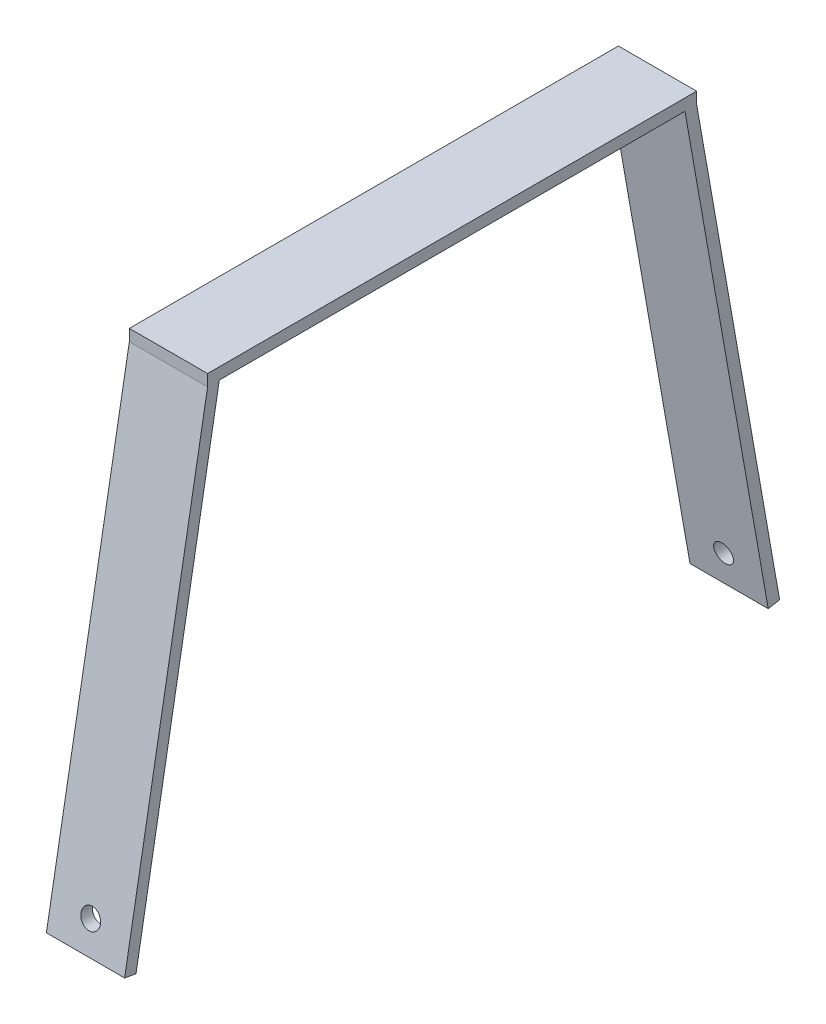
ISO-10303-21;
HEADER;
FILE_DESCRIPTION(('STEP AP214'),'2;1');
FILE_NAME('part.step','',(''),(''),'','','');
FILE_SCHEMA(('AUTOMOTIVE_DESIGN { 1 0 10303 214 1 1 1 1 }'));
ENDSEC;
DATA;
#1=APPLICATION_CONTEXT('core data for automotive mechanical design processes');
#2=APPLICATION_PROTOCOL_DEFINITION('international standard','automotive_design',2000,#1);
#3=PRODUCT_CONTEXT('',#1,'mechanical');
#4=PRODUCT('Part','Part','',(#3));
#5=PRODUCT_RELATED_PRODUCT_CATEGORY('part','',(#4));
#6=PRODUCT_DEFINITION_FORMATION('','',#4);
#7=PRODUCT_DEFINITION_CONTEXT('part definition',#1,'design');
#8=PRODUCT_DEFINITION('design','',#6,#7);
#9=PRODUCT_DEFINITION_SHAPE('','',#8);
#10=(LENGTH_UNIT() NAMED_UNIT(*) SI_UNIT(.MILLI.,.METRE.));
#11=(NAMED_UNIT(*) PLANE_ANGLE_UNIT() SI_UNIT($,.RADIAN.));
#12=(NAMED_UNIT(*) SI_UNIT($,.STERADIAN.) SOLID_ANGLE_UNIT());
#13=UNCERTAINTY_MEASURE_WITH_UNIT(LENGTH_MEASURE(1.E-05),#10,'distance_accuracy_value','');
#14=(GEOMETRIC_REPRESENTATION_CONTEXT(3) GLOBAL_UNCERTAINTY_ASSIGNED_CONTEXT((#13)) GLOBAL_UNIT_ASSIGNED_CONTEXT((#10,
#11,#12)) REPRESENTATION_CONTEXT('',''));
#15=CARTESIAN_POINT('',(0.,0.,0.));
#16=DIRECTION('',(0.,0.,1.));
#17=DIRECTION('',(1.,0.,0.));
#18=AXIS2_PLACEMENT_3D('',#15,#16,#17);
#19=CARTESIAN_POINT('',(0.,0.,0.));
#20=DIRECTION('',(0.,-1.,0.));
#21=DIRECTION('',(0.,0.,-1.));
#22=AXIS2_PLACEMENT_3D('',#19,#20,#21);
#23=PLANE('',#22);
#24=DIRECTION('',(0.,0.,1.));
#25=VECTOR('',#24,1.);
#26=CARTESIAN_POINT('',(-10.16,0.,63.5));
#27=LINE('',#26,#25);
#28=CARTESIAN_POINT('',(-10.16,0.,-60.4537262569024));
#29=VERTEX_POINT('',#28);
#30=CARTESIAN_POINT('',(-10.16,0.,60.4537262569024));
#31=VERTEX_POINT('',#30);
#32=EDGE_CURVE('E122',#29,#31,#27,.T.);
#33=ORIENTED_EDGE('',*,*,#32,.F.);
#34=DIRECTION('',(1.,0.,0.));
#35=VECTOR('',#34,1.);
#36=CARTESIAN_POINT('',(0.,0.,-60.4537262569024));
#37=LINE('',#36,#35);
#38=CARTESIAN_POINT('',(10.16,0.,-60.4537262569024));
#39=VERTEX_POINT('',#38);
#40=EDGE_CURVE('E159',#29,#39,#37,.T.);
#41=ORIENTED_EDGE('',*,*,#40,.T.);
#42=DIRECTION('',(0.,0.,-1.));
#43=VECTOR('',#42,1.);
#44=CARTESIAN_POINT('',(10.16,0.,63.5));
#45=LINE('',#44,#43);
#46=CARTESIAN_POINT('',(10.16,0.,60.4537262569024));
#47=VERTEX_POINT('',#46);
#48=EDGE_CURVE('E117',#47,#39,#45,.T.);
#49=ORIENTED_EDGE('',*,*,#48,.F.);
#50=DIRECTION('',(-1.,0.,0.));
#51=VECTOR('',#50,1.);
#52=CARTESIAN_POINT('',(0.,0.,60.4537262569024));
#53=LINE('',#52,#51);
#54=EDGE_CURVE('E11',#47,#31,#53,.T.);
#55=ORIENTED_EDGE('',*,*,#54,.T.);
#56=EDGE_LOOP('',(#33,#41,#49,#55));
#57=FACE_BOUND('',#56,.T.);
#58=ADVANCED_FACE('F35',(#57),#23,.T.);
#59=CARTESIAN_POINT('',(10.16,2.999994,63.5));
#60=DIRECTION('',(0.,0.,-1.));
#61=DIRECTION('',(-1.,0.,0.));
#62=AXIS2_PLACEMENT_3D('',#59,#60,#61);
#63=PLANE('',#62);
#64=DIRECTION('',(1.,0.,0.));
#65=VECTOR('',#64,1.);
#66=CARTESIAN_POINT('',(10.16,0.,63.5));
#67=LINE('',#66,#65);
#68=CARTESIAN_POINT('',(-10.16,0.,63.5));
#69=VERTEX_POINT('',#68);
#70=CARTESIAN_POINT('',(10.16,0.,63.5));
#71=VERTEX_POINT('',#70);
#72=EDGE_CURVE('E114',#69,#71,#67,.T.);
#73=ORIENTED_EDGE('',*,*,#72,.T.);
#74=DIRECTION('',(0.,-1.,0.));
#75=VECTOR('',#74,1.);
#76=CARTESIAN_POINT('',(10.16,2.999994,63.5));
#77=LINE('',#76,#75);
#78=CARTESIAN_POINT('',(10.16,2.999994,63.5));
#79=VERTEX_POINT('',#78);
#80=EDGE_CURVE('E45',#79,#71,#77,.T.);
#81=ORIENTED_EDGE('',*,*,#80,.F.);
#82=DIRECTION('',(1.,0.,0.));
#83=VECTOR('',#82,1.);
#84=CARTESIAN_POINT('',(10.16,2.999994,63.5));
#85=LINE('',#84,#83);
#86=CARTESIAN_POINT('',(-10.16,2.999994,63.5));
#87=VERTEX_POINT('',#86);
#88=EDGE_CURVE('E90',#87,#79,#85,.T.);
#89=ORIENTED_EDGE('',*,*,#88,.F.);
#90=DIRECTION('',(0.,-1.,0.));
#91=VECTOR('',#90,1.);
#92=CARTESIAN_POINT('',(-10.16,2.999994,63.5));
#93=LINE('',#92,#91);
#94=EDGE_CURVE('E110',#87,#69,#93,.T.);
#95=ORIENTED_EDGE('',*,*,#94,.T.);
#96=EDGE_LOOP('',(#73,#81,#89,#95));
#97=FACE_BOUND('',#96,.T.);
#98=ADVANCED_FACE('F37',(#97),#63,.F.);
#99=CARTESIAN_POINT('',(10.16,2.999994,63.5));
#100=DIRECTION('',(-1.,0.,0.));
#101=DIRECTION('',(0.,0.,1.));
#102=AXIS2_PLACEMENT_3D('',#99,#100,#101);
#103=PLANE('',#102);
#104=ORIENTED_EDGE('',*,*,#48,.T.);
#105=DIRECTION('',(0.,-0.984807753012208,-0.173648177666931));
#106=VECTOR('',#105,1.);
#107=CARTESIAN_POINT('',(10.16,10.3381960594783,-58.6308233597625));
#108=LINE('',#107,#106);
#109=CARTESIAN_POINT('',(10.16,-122.681995011561,-82.085872024582));
#110=VERTEX_POINT('',#109);
#111=EDGE_CURVE('E172',#39,#110,#108,.T.);
#112=ORIENTED_EDGE('',*,*,#111,.T.);
#113=DIRECTION('',(0.,0.173648177666931,-0.984807753012208));
#114=VECTOR('',#113,1.);
#115=CARTESIAN_POINT('',(10.16,-122.681995011561,-82.085872024582));
#116=LINE('',#115,#114);
#117=CARTESIAN_POINT('',(10.16,-122.161051520449,-85.0402893747721));
#118=VERTEX_POINT('',#117);
#119=EDGE_CURVE('E161',#110,#118,#116,.T.);
#120=ORIENTED_EDGE('',*,*,#119,.T.);
#121=DIRECTION('',(0.,-0.984807753012208,-0.173648177666931));
#122=VECTOR('',#121,1.);
#123=CARTESIAN_POINT('',(10.16,10.85913955059,-61.5852407099526));
#124=LINE('',#123,#122);
#125=CARTESIAN_POINT('',(10.16,0.,-63.5));
#126=VERTEX_POINT('',#125);
#127=EDGE_CURVE('E102',#126,#118,#124,.T.);
#128=ORIENTED_EDGE('',*,*,#127,.F.);
#129=DIRECTION('',(0.,-1.,0.));
#130=VECTOR('',#129,1.);
#131=CARTESIAN_POINT('',(10.16,2.999994,-63.5));
#132=LINE('',#131,#130);
#133=CARTESIAN_POINT('',(10.16,2.999994,-63.5));
#134=VERTEX_POINT('',#133);
#135=EDGE_CURVE('E96',#134,#126,#132,.T.);
#136=ORIENTED_EDGE('',*,*,#135,.F.);
#137=DIRECTION('',(0.,0.,-1.));
#138=VECTOR('',#137,1.);
#139=CARTESIAN_POINT('',(10.16,2.999994,63.5));
#140=LINE('',#139,#138);
#141=EDGE_CURVE('E83',#79,#134,#140,.T.);
#142=ORIENTED_EDGE('',*,*,#141,.F.);
#143=ORIENTED_EDGE('',*,*,#80,.T.);
#144=DIRECTION('',(0.,-0.984807753012208,0.173648177666931));
#145=VECTOR('',#144,1.);
#146=CARTESIAN_POINT('',(10.16,10.85913955059,61.5852407099526));
#147=LINE('',#146,#145);
#148=CARTESIAN_POINT('',(10.16,-122.161051520449,85.0402893747721));
#149=VERTEX_POINT('',#148);
#150=EDGE_CURVE('E65',#71,#149,#147,.T.);
#151=ORIENTED_EDGE('',*,*,#150,.T.);
#152=DIRECTION('',(0.,0.173648177666931,0.984807753012208));
#153=VECTOR('',#152,1.);
#154=CARTESIAN_POINT('',(10.16,-122.681995011561,82.085872024582));
#155=LINE('',#154,#153);
#156=CARTESIAN_POINT('',(10.16,-122.681995011561,82.085872024582));
#157=VERTEX_POINT('',#156);
#158=EDGE_CURVE('E153',#157,#149,#155,.T.);
#159=ORIENTED_EDGE('',*,*,#158,.F.);
#160=DIRECTION('',(0.,-0.984807753012208,0.173648177666931));
#161=VECTOR('',#160,1.);
#162=CARTESIAN_POINT('',(10.16,10.3381960594783,58.6308233597625));
#163=LINE('',#162,#161);
#164=EDGE_CURVE('E146',#47,#157,#163,.T.);
#165=ORIENTED_EDGE('',*,*,#164,.F.);
#166=EDGE_LOOP('',(#104,#112,#120,#128,#136,#142,#143,#151,#159,#165));
#167=FACE_BOUND('',#166,.T.);
#168=ADVANCED_FACE('F98',(#167),#103,.F.);
#169=CARTESIAN_POINT('',(-10.16,2.999994,-63.5));
#170=DIRECTION('',(0.,0.,1.));
#171=DIRECTION('',(1.,0.,0.));
#172=AXIS2_PLACEMENT_3D('',#169,#170,#171);
#173=PLANE('',#172);
#174=DIRECTION('',(-1.,0.,0.));
#175=VECTOR('',#174,1.);
#176=CARTESIAN_POINT('',(-10.16,0.,-63.5));
#177=LINE('',#176,#175);
#178=CARTESIAN_POINT('',(-10.16,0.,-63.5));
#179=VERTEX_POINT('',#178);
#180=EDGE_CURVE('E120',#126,#179,#177,.T.);
#181=ORIENTED_EDGE('',*,*,#180,.T.);
#182=DIRECTION('',(0.,-1.,0.));
#183=VECTOR('',#182,1.);
#184=CARTESIAN_POINT('',(-10.16,2.999994,-63.5));
#185=LINE('',#184,#183);
#186=CARTESIAN_POINT('',(-10.16,2.999994,-63.5));
#187=VERTEX_POINT('',#186);
#188=EDGE_CURVE('E105',#187,#179,#185,.T.);
#189=ORIENTED_EDGE('',*,*,#188,.F.);
#190=DIRECTION('',(-1.,0.,0.));
#191=VECTOR('',#190,1.);
#192=CARTESIAN_POINT('',(-10.16,2.999994,-63.5));
#193=LINE('',#192,#191);
#194=EDGE_CURVE('E87',#134,#187,#193,.T.);
#195=ORIENTED_EDGE('',*,*,#194,.F.);
#196=ORIENTED_EDGE('',*,*,#135,.T.);
#197=EDGE_LOOP('',(#181,#189,#195,#196));
#198=FACE_BOUND('',#197,.T.);
#199=ADVANCED_FACE('F107',(#198),#173,.F.);
#200=CARTESIAN_POINT('',(-10.16,2.999994,63.5));
#201=DIRECTION('',(1.,0.,0.));
#202=DIRECTION('',(0.,0.,-1.));
#203=AXIS2_PLACEMENT_3D('',#200,#201,#202);
#204=PLANE('',#203);
#205=ORIENTED_EDGE('',*,*,#188,.T.);
#206=DIRECTION('',(0.,0.984807753012208,0.173648177666931));
#207=VECTOR('',#206,1.);
#208=CARTESIAN_POINT('',(-10.16,10.85913955059,-61.5852407099526));
#209=LINE('',#208,#207);
#210=CARTESIAN_POINT('',(-10.16,-122.161051520449,-85.0402893747721));
#211=VERTEX_POINT('',#210);
#212=EDGE_CURVE('E176',#211,#179,#209,.T.);
#213=ORIENTED_EDGE('',*,*,#212,.F.);
#214=DIRECTION('',(0.,0.173648177666931,-0.984807753012208));
#215=VECTOR('',#214,1.);
#216=CARTESIAN_POINT('',(-10.16,-122.681995011561,-82.085872024582));
#217=LINE('',#216,#215);
#218=CARTESIAN_POINT('',(-10.16,-122.681995011561,-82.085872024582));
#219=VERTEX_POINT('',#218);
#220=EDGE_CURVE('E168',#219,#211,#217,.T.);
#221=ORIENTED_EDGE('',*,*,#220,.F.);
#222=DIRECTION('',(0.,0.984807753012208,0.173648177666931));
#223=VECTOR('',#222,1.);
#224=CARTESIAN_POINT('',(-10.16,10.3381960594783,-58.6308233597625));
#225=LINE('',#224,#223);
#226=EDGE_CURVE('E184',#219,#29,#225,.T.);
#227=ORIENTED_EDGE('',*,*,#226,.T.);
#228=ORIENTED_EDGE('',*,*,#32,.T.);
#229=DIRECTION('',(0.,0.984807753012208,-0.173648177666931));
#230=VECTOR('',#229,1.);
#231=CARTESIAN_POINT('',(-10.16,10.3381960594783,58.6308233597625));
#232=LINE('',#231,#230);
#233=CARTESIAN_POINT('',(-10.16,-122.681995011561,82.085872024582));
#234=VERTEX_POINT('',#233);
#235=EDGE_CURVE('E154',#234,#31,#232,.T.);
#236=ORIENTED_EDGE('',*,*,#235,.F.);
#237=DIRECTION('',(0.,0.173648177666931,0.984807753012208));
#238=VECTOR('',#237,1.);
#239=CARTESIAN_POINT('',(-10.16,-122.681995011561,82.085872024582));
#240=LINE('',#239,#238);
#241=CARTESIAN_POINT('',(-10.16,-122.161051520449,85.0402893747721));
#242=VERTEX_POINT('',#241);
#243=EDGE_CURVE('E118',#234,#242,#240,.T.);
#244=ORIENTED_EDGE('',*,*,#243,.T.);
#245=DIRECTION('',(0.,0.984807753012208,-0.173648177666931));
#246=VECTOR('',#245,1.);
#247=CARTESIAN_POINT('',(-10.16,10.85913955059,61.5852407099526));
#248=LINE('',#247,#246);
#249=EDGE_CURVE('E135',#242,#69,#248,.T.);
#250=ORIENTED_EDGE('',*,*,#249,.T.);
#251=ORIENTED_EDGE('',*,*,#94,.F.);
#252=DIRECTION('',(0.,0.,1.));
#253=VECTOR('',#252,1.);
#254=CARTESIAN_POINT('',(-10.16,2.999994,63.5));
#255=LINE('',#254,#253);
#256=EDGE_CURVE('E53',#187,#87,#255,.T.);
#257=ORIENTED_EDGE('',*,*,#256,.F.);
#258=EDGE_LOOP('',(#205,#213,#221,#227,#228,#236,#244,#250,#251,#257));
#259=FACE_BOUND('',#258,.T.);
#260=ADVANCED_FACE('F140',(#259),#204,.F.);
#261=CARTESIAN_POINT('',(0.,2.999994,0.));
#262=DIRECTION('',(0.,-1.,0.));
#263=DIRECTION('',(0.,0.,-1.));
#264=AXIS2_PLACEMENT_3D('',#261,#262,#263);
#265=PLANE('',#264);
#266=ORIENTED_EDGE('',*,*,#88,.T.);
#267=ORIENTED_EDGE('',*,*,#141,.T.);
#268=ORIENTED_EDGE('',*,*,#194,.T.);
#269=ORIENTED_EDGE('',*,*,#256,.T.);
#270=EDGE_LOOP('',(#266,#267,#268,#269));
#271=FACE_BOUND('',#270,.T.);
#272=ADVANCED_FACE('F85',(#271),#265,.F.);
#273=CARTESIAN_POINT('',(0.,-122.681995011561,82.085872024582));
#274=DIRECTION('',(0.,-0.984807753012208,0.173648177666931));
#275=DIRECTION('',(0.,-0.173648177666931,-0.984807753012208));
#276=AXIS2_PLACEMENT_3D('',#273,#274,#275);
#277=PLANE('',#276);
#278=DIRECTION('',(1.,0.,0.));
#279=VECTOR('',#278,1.);
#280=CARTESIAN_POINT('',(0.,-122.161051520449,85.0402893747721));
#281=LINE('',#280,#279);
#282=EDGE_CURVE('E148',#242,#149,#281,.T.);
#283=ORIENTED_EDGE('',*,*,#282,.F.);
#284=ORIENTED_EDGE('',*,*,#243,.F.);
#285=DIRECTION('',(1.,0.,0.));
#286=VECTOR('',#285,1.);
#287=CARTESIAN_POINT('',(0.,-122.681995011561,82.085872024582));
#288=LINE('',#287,#286);
#289=EDGE_CURVE('E143',#234,#157,#288,.T.);
#290=ORIENTED_EDGE('',*,*,#289,.T.);
#291=ORIENTED_EDGE('',*,*,#158,.T.);
#292=EDGE_LOOP('',(#283,#284,#290,#291));
#293=FACE_BOUND('',#292,.T.);
#294=ADVANCED_FACE('F246',(#293),#277,.T.);
#295=CARTESIAN_POINT('',(0.,10.3381960594783,58.6308233597625));
#296=DIRECTION('',(0.,0.173648177666931,0.984807753012208));
#297=DIRECTION('',(0.,-0.984807753012208,0.173648177666931));
#298=AXIS2_PLACEMENT_3D('',#295,#296,#297);
#299=PLANE('',#298);
#300=CARTESIAN_POINT('',(0.,-114.541051520449,80.6504040386761));
#301=DIRECTION('',(0.,0.173648177666931,0.984807753012208));
#302=DIRECTION('',(0.,-0.984807753012208,0.173648177666931));
#303=AXIS2_PLACEMENT_3D('',#300,#301,#302);
#304=ELLIPSE('',#303,2.57918359418979,2.54);
#305=CARTESIAN_POINT('',(0.,-117.081051520449,81.0982745696756));
#306=VERTEX_POINT('',#305);
#307=EDGE_CURVE('E181',#306,#306,#304,.T.);
#308=ORIENTED_EDGE('',*,*,#307,.T.);
#309=EDGE_LOOP('',(#308));
#310=FACE_BOUND('',#309,.T.);
#311=ORIENTED_EDGE('',*,*,#54,.F.);
#312=ORIENTED_EDGE('',*,*,#164,.T.);
#313=ORIENTED_EDGE('',*,*,#289,.F.);
#314=ORIENTED_EDGE('',*,*,#235,.T.);
#315=EDGE_LOOP('',(#311,#312,#313,#314));
#316=FACE_BOUND('',#315,.T.);
#317=ADVANCED_FACE('F252',(#310,#316),#299,.F.);
#318=CARTESIAN_POINT('',(0.,10.85913955059,61.5852407099526));
#319=DIRECTION('',(0.,0.173648177666931,0.984807753012208));
#320=DIRECTION('',(0.,-0.984807753012208,0.173648177666931));
#321=AXIS2_PLACEMENT_3D('',#318,#319,#320);
#322=PLANE('',#321);
#323=CARTESIAN_POINT('',(0.,-114.541051520449,83.6966777817736));
#324=DIRECTION('',(0.,0.173648177666931,0.984807753012208));
#325=DIRECTION('',(0.,-0.984807753012208,0.173648177666931));
#326=AXIS2_PLACEMENT_3D('',#323,#324,#325);
#327=ELLIPSE('',#326,2.57918359418979,2.54);
#328=CARTESIAN_POINT('',(0.,-117.081051520449,84.1445483127731));
#329=VERTEX_POINT('',#328);
#330=EDGE_CURVE('E191',#329,#329,#327,.T.);
#331=ORIENTED_EDGE('',*,*,#330,.F.);
#332=EDGE_LOOP('',(#331));
#333=FACE_BOUND('',#332,.T.);
#334=ORIENTED_EDGE('',*,*,#150,.F.);
#335=ORIENTED_EDGE('',*,*,#72,.F.);
#336=ORIENTED_EDGE('',*,*,#249,.F.);
#337=ORIENTED_EDGE('',*,*,#282,.T.);
#338=EDGE_LOOP('',(#334,#335,#336,#337));
#339=FACE_BOUND('',#338,.T.);
#340=ADVANCED_FACE('F133',(#333,#339),#322,.T.);
#341=CARTESIAN_POINT('',(0.,10.85913955059,-61.5852407099526));
#342=DIRECTION('',(0.,0.173648177666931,-0.984807753012208));
#343=DIRECTION('',(0.,-0.984807753012208,-0.173648177666931));
#344=AXIS2_PLACEMENT_3D('',#341,#342,#343);
#345=PLANE('',#344);
#346=CARTESIAN_POINT('',(0.,-114.541051520449,-83.6966777817736));
#347=DIRECTION('',(0.,0.173648177666931,-0.984807753012208));
#348=DIRECTION('',(0.,0.984807753012208,0.173648177666931));
#349=AXIS2_PLACEMENT_3D('',#346,#347,#348);
#350=ELLIPSE('',#349,2.57918359418979,2.54);
#351=CARTESIAN_POINT('',(0.,-112.001051520449,-83.2488072507741));
#352=VERTEX_POINT('',#351);
#353=EDGE_CURVE('E194',#352,#352,#350,.T.);
#354=ORIENTED_EDGE('',*,*,#353,.F.);
#355=EDGE_LOOP('',(#354));
#356=FACE_BOUND('',#355,.T.);
#357=ORIENTED_EDGE('',*,*,#180,.F.);
#358=ORIENTED_EDGE('',*,*,#127,.T.);
#359=DIRECTION('',(1.,0.,0.));
#360=VECTOR('',#359,1.);
#361=CARTESIAN_POINT('',(0.,-122.161051520449,-85.0402893747721));
#362=LINE('',#361,#360);
#363=EDGE_CURVE('E178',#211,#118,#362,.T.);
#364=ORIENTED_EDGE('',*,*,#363,.F.);
#365=ORIENTED_EDGE('',*,*,#212,.T.);
#366=EDGE_LOOP('',(#357,#358,#364,#365));
#367=FACE_BOUND('',#366,.T.);
#368=ADVANCED_FACE('F265',(#356,#367),#345,.T.);
#369=CARTESIAN_POINT('',(0.,-122.681995011561,-82.085872024582));
#370=DIRECTION('',(0.,0.984807753012208,0.173648177666931));
#371=DIRECTION('',(0.,-0.173648177666931,0.984807753012208));
#372=AXIS2_PLACEMENT_3D('',#369,#370,#371);
#373=PLANE('',#372);
#374=ORIENTED_EDGE('',*,*,#363,.T.);
#375=ORIENTED_EDGE('',*,*,#119,.F.);
#376=DIRECTION('',(1.,0.,0.));
#377=VECTOR('',#376,1.);
#378=CARTESIAN_POINT('',(0.,-122.681995011561,-82.085872024582));
#379=LINE('',#378,#377);
#380=EDGE_CURVE('E175',#219,#110,#379,.T.);
#381=ORIENTED_EDGE('',*,*,#380,.F.);
#382=ORIENTED_EDGE('',*,*,#220,.T.);
#383=EDGE_LOOP('',(#374,#375,#381,#382));
#384=FACE_BOUND('',#383,.T.);
#385=ADVANCED_FACE('F213',(#384),#373,.F.);
#386=CARTESIAN_POINT('',(0.,10.3381960594783,-58.6308233597625));
#387=DIRECTION('',(0.,0.173648177666931,-0.984807753012208));
#388=DIRECTION('',(0.,-0.984807753012208,-0.173648177666931));
#389=AXIS2_PLACEMENT_3D('',#386,#387,#388);
#390=PLANE('',#389);
#391=CARTESIAN_POINT('',(0.,-114.541051520449,-80.6504040386761));
#392=DIRECTION('',(0.,0.173648177666931,-0.984807753012208));
#393=DIRECTION('',(0.,0.984807753012208,0.173648177666931));
#394=AXIS2_PLACEMENT_3D('',#391,#392,#393);
#395=ELLIPSE('',#394,2.57918359418979,2.54);
#396=CARTESIAN_POINT('',(0.,-112.001051520449,-80.2025335076766));
#397=VERTEX_POINT('',#396);
#398=EDGE_CURVE('E39',#397,#397,#395,.T.);
#399=ORIENTED_EDGE('',*,*,#398,.T.);
#400=EDGE_LOOP('',(#399));
#401=FACE_BOUND('',#400,.T.);
#402=ORIENTED_EDGE('',*,*,#40,.F.);
#403=ORIENTED_EDGE('',*,*,#226,.F.);
#404=ORIENTED_EDGE('',*,*,#380,.T.);
#405=ORIENTED_EDGE('',*,*,#111,.F.);
#406=EDGE_LOOP('',(#402,#403,#404,#405));
#407=FACE_BOUND('',#406,.T.);
#408=ADVANCED_FACE('F201',(#401,#407),#390,.F.);
#409=CARTESIAN_POINT('',(0.,-114.541051520449,-85.0402893747721));
#410=DIRECTION('',(0.,0.,1.));
#411=DIRECTION('',(1.,0.,0.));
#412=AXIS2_PLACEMENT_3D('',#409,#410,#411);
#413=CYLINDRICAL_SURFACE('',#412,2.54);
#414=ORIENTED_EDGE('',*,*,#353,.T.);
#415=EDGE_LOOP('',(#414));
#416=FACE_BOUND('',#415,.T.);
#417=ORIENTED_EDGE('',*,*,#398,.F.);
#418=EDGE_LOOP('',(#417));
#419=FACE_BOUND('',#418,.T.);
#420=ADVANCED_FACE('F204',(#416,#419),#413,.F.);
#421=ORIENTED_EDGE('',*,*,#330,.T.);
#422=EDGE_LOOP('',(#421));
#423=FACE_BOUND('',#422,.T.);
#424=ORIENTED_EDGE('',*,*,#307,.F.);
#425=EDGE_LOOP('',(#424));
#426=FACE_BOUND('',#425,.T.);
#427=ADVANCED_FACE('F206',(#423,#426),#413,.F.);
#428=CLOSED_SHELL('',(#58,#98,#168,#199,#260,#272,#294,#317,#340,#368,#385,#408,#420,#427));
#429=MANIFOLD_SOLID_BREP('B2',#428);
#430=ADVANCED_BREP_SHAPE_REPRESENTATION('',(#18,#429),#14);
#431=SHAPE_DEFINITION_REPRESENTATION(#9,#430);
ENDSEC;
END-ISO-10303-21;
